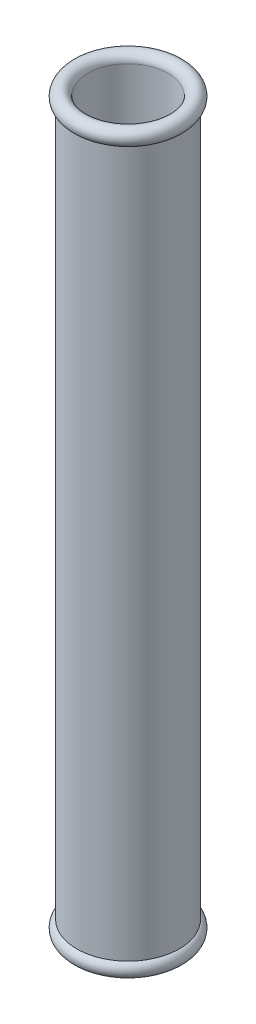
ISO-10303-21;
HEADER;
FILE_DESCRIPTION(('STEP AP214'),'2;1');
FILE_NAME('part.step','',(''),(''),'','','');
FILE_SCHEMA(('AUTOMOTIVE_DESIGN { 1 0 10303 214 1 1 1 1 }'));
ENDSEC;
DATA;
#1=APPLICATION_CONTEXT('core data for automotive mechanical design processes');
#2=APPLICATION_PROTOCOL_DEFINITION('international standard','automotive_design',2000,#1);
#3=PRODUCT_CONTEXT('',#1,'mechanical');
#4=PRODUCT('Part','Part','',(#3));
#5=PRODUCT_RELATED_PRODUCT_CATEGORY('part','',(#4));
#6=PRODUCT_DEFINITION_FORMATION('','',#4);
#7=PRODUCT_DEFINITION_CONTEXT('part definition',#1,'design');
#8=PRODUCT_DEFINITION('design','',#6,#7);
#9=PRODUCT_DEFINITION_SHAPE('','',#8);
#10=(LENGTH_UNIT() NAMED_UNIT(*) SI_UNIT(.MILLI.,.METRE.));
#11=(NAMED_UNIT(*) PLANE_ANGLE_UNIT() SI_UNIT($,.RADIAN.));
#12=(NAMED_UNIT(*) SI_UNIT($,.STERADIAN.) SOLID_ANGLE_UNIT());
#13=UNCERTAINTY_MEASURE_WITH_UNIT(LENGTH_MEASURE(1.E-05),#10,'distance_accuracy_value','');
#14=(GEOMETRIC_REPRESENTATION_CONTEXT(3) GLOBAL_UNCERTAINTY_ASSIGNED_CONTEXT((#13)) GLOBAL_UNIT_ASSIGNED_CONTEXT((#10,
#11,#12)) REPRESENTATION_CONTEXT('',''));
#15=CARTESIAN_POINT('',(0.,0.,0.));
#16=DIRECTION('',(0.,0.,1.));
#17=DIRECTION('',(1.,0.,0.));
#18=AXIS2_PLACEMENT_3D('',#15,#16,#17);
#19=CARTESIAN_POINT('',(0.,0.,0.));
#20=DIRECTION('',(0.,-1.,0.));
#21=DIRECTION('',(0.,0.,-1.));
#22=AXIS2_PLACEMENT_3D('',#19,#20,#21);
#23=TOROIDAL_SURFACE('',#22,2.1,0.35);
#24=CARTESIAN_POINT('',(0.,0.316227766016838,0.));
#25=DIRECTION('',(0.,-1.,0.));
#26=DIRECTION('',(0.,0.,-1.));
#27=AXIS2_PLACEMENT_3D('',#24,#25,#26);
#28=CIRCLE('',#27,2.25);
#29=CARTESIAN_POINT('',(0.,0.316227766016838,-2.25));
#30=VERTEX_POINT('',#29);
#31=EDGE_CURVE('E10',#30,#30,#28,.T.);
#32=ORIENTED_EDGE('',*,*,#31,.T.);
#33=EDGE_LOOP('',(#32));
#34=FACE_BOUND('',#33,.T.);
#35=CARTESIAN_POINT('',(0.,0.,0.));
#36=DIRECTION('',(0.,-1.,0.));
#37=DIRECTION('',(0.,0.,-1.));
#38=AXIS2_PLACEMENT_3D('',#35,#36,#37);
#39=CIRCLE('',#38,1.75);
#40=CARTESIAN_POINT('',(0.,0.,-1.75));
#41=VERTEX_POINT('',#40);
#42=EDGE_CURVE('E53',#41,#41,#39,.T.);
#43=ORIENTED_EDGE('',*,*,#42,.F.);
#44=EDGE_LOOP('',(#43));
#45=FACE_BOUND('',#44,.T.);
#46=ADVANCED_FACE('F39',(#34,#45),#23,.T.);
#47=CARTESIAN_POINT('',(0.,0.,0.));
#48=DIRECTION('',(0.,-1.,0.));
#49=DIRECTION('',(0.,0.,-1.));
#50=AXIS2_PLACEMENT_3D('',#47,#48,#49);
#51=CYLINDRICAL_SURFACE('',#50,2.25);
#52=CARTESIAN_POINT('',(0.,31.2837722339832,0.));
#53=DIRECTION('',(0.,-1.,0.));
#54=DIRECTION('',(0.,0.,-1.));
#55=AXIS2_PLACEMENT_3D('',#52,#53,#54);
#56=CIRCLE('',#55,2.25);
#57=CARTESIAN_POINT('',(0.,31.2837722339832,-2.25));
#58=VERTEX_POINT('',#57);
#59=EDGE_CURVE('E45',#58,#58,#56,.T.);
#60=ORIENTED_EDGE('',*,*,#59,.T.);
#61=EDGE_LOOP('',(#60));
#62=FACE_BOUND('',#61,.T.);
#63=ORIENTED_EDGE('',*,*,#31,.F.);
#64=EDGE_LOOP('',(#63));
#65=FACE_BOUND('',#64,.T.);
#66=ADVANCED_FACE('F62',(#62,#65),#51,.T.);
#67=CARTESIAN_POINT('',(0.,31.6,0.));
#68=DIRECTION('',(0.,-1.,0.));
#69=DIRECTION('',(0.,0.,-1.));
#70=AXIS2_PLACEMENT_3D('',#67,#68,#69);
#71=TOROIDAL_SURFACE('',#70,2.1,0.350000000000001);
#72=CARTESIAN_POINT('',(0.,31.6,0.));
#73=DIRECTION('',(0.,-1.,0.));
#74=DIRECTION('',(0.,0.,-1.));
#75=AXIS2_PLACEMENT_3D('',#72,#73,#74);
#76=CIRCLE('',#75,1.75);
#77=CARTESIAN_POINT('',(0.,31.6,-1.75));
#78=VERTEX_POINT('',#77);
#79=EDGE_CURVE('E49',#78,#78,#76,.T.);
#80=ORIENTED_EDGE('',*,*,#79,.T.);
#81=EDGE_LOOP('',(#80));
#82=FACE_BOUND('',#81,.T.);
#83=ORIENTED_EDGE('',*,*,#59,.F.);
#84=EDGE_LOOP('',(#83));
#85=FACE_BOUND('',#84,.T.);
#86=ADVANCED_FACE('F66',(#82,#85),#71,.T.);
#87=CARTESIAN_POINT('',(0.,0.,0.));
#88=DIRECTION('',(0.,-1.,0.));
#89=DIRECTION('',(0.,0.,-1.));
#90=AXIS2_PLACEMENT_3D('',#87,#88,#89);
#91=CYLINDRICAL_SURFACE('',#90,1.75);
#92=ORIENTED_EDGE('',*,*,#79,.F.);
#93=EDGE_LOOP('',(#92));
#94=FACE_BOUND('',#93,.T.);
#95=ORIENTED_EDGE('',*,*,#42,.T.);
#96=EDGE_LOOP('',(#95));
#97=FACE_BOUND('',#96,.T.);
#98=ADVANCED_FACE('F59',(#94,#97),#91,.F.);
#99=CLOSED_SHELL('',(#46,#66,#86,#98));
#100=MANIFOLD_SOLID_BREP('B2',#99);
#101=ADVANCED_BREP_SHAPE_REPRESENTATION('',(#18,#100),#14);
#102=SHAPE_DEFINITION_REPRESENTATION(#9,#101);
ENDSEC;
END-ISO-10303-21;
